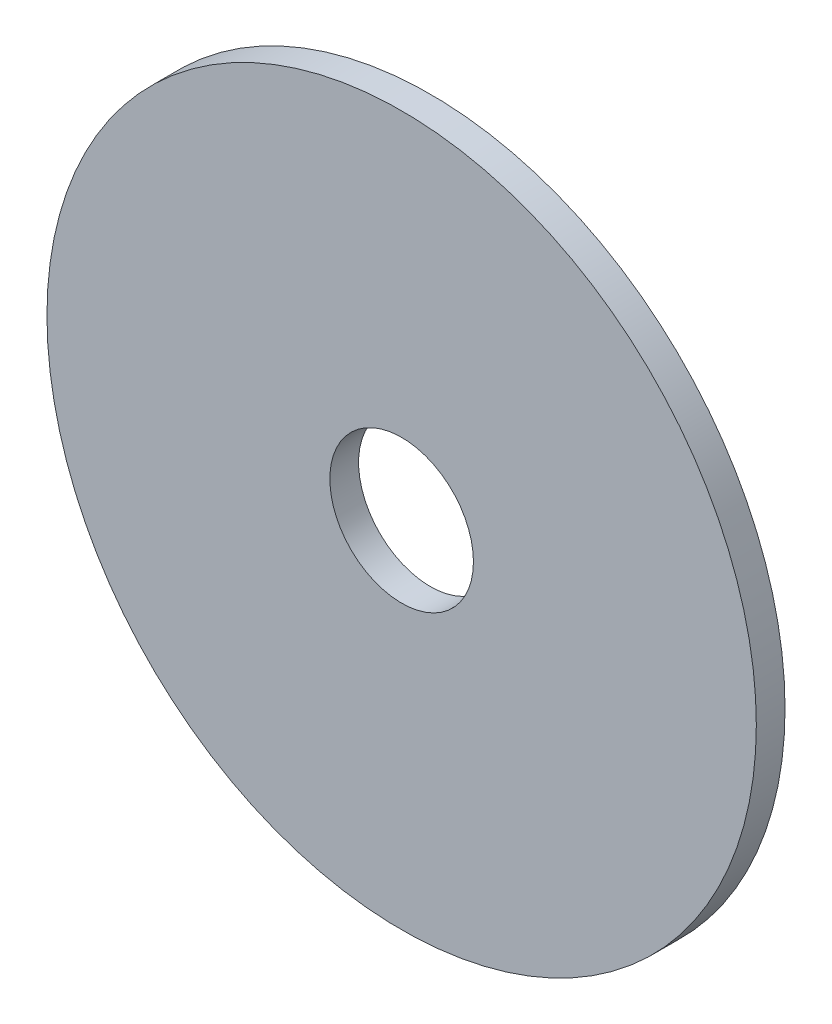
ISO-10303-21;
HEADER;
FILE_DESCRIPTION(('STEP AP214'),'2;1');
FILE_NAME('part.step','',(''),(''),'','','');
FILE_SCHEMA(('AUTOMOTIVE_DESIGN { 1 0 10303 214 1 1 1 1 }'));
ENDSEC;
DATA;
#1=APPLICATION_CONTEXT('core data for automotive mechanical design processes');
#2=APPLICATION_PROTOCOL_DEFINITION('international standard','automotive_design',2000,#1);
#3=PRODUCT_CONTEXT('',#1,'mechanical');
#4=PRODUCT('Part','Part','',(#3));
#5=PRODUCT_RELATED_PRODUCT_CATEGORY('part','',(#4));
#6=PRODUCT_DEFINITION_FORMATION('','',#4);
#7=PRODUCT_DEFINITION_CONTEXT('part definition',#1,'design');
#8=PRODUCT_DEFINITION('design','',#6,#7);
#9=PRODUCT_DEFINITION_SHAPE('','',#8);
#10=(LENGTH_UNIT() NAMED_UNIT(*) SI_UNIT(.MILLI.,.METRE.));
#11=(NAMED_UNIT(*) PLANE_ANGLE_UNIT() SI_UNIT($,.RADIAN.));
#12=(NAMED_UNIT(*) SI_UNIT($,.STERADIAN.) SOLID_ANGLE_UNIT());
#13=UNCERTAINTY_MEASURE_WITH_UNIT(LENGTH_MEASURE(1.E-05),#10,'distance_accuracy_value','');
#14=(GEOMETRIC_REPRESENTATION_CONTEXT(3) GLOBAL_UNCERTAINTY_ASSIGNED_CONTEXT((#13)) GLOBAL_UNIT_ASSIGNED_CONTEXT((#10,
#11,#12)) REPRESENTATION_CONTEXT('',''));
#15=CARTESIAN_POINT('',(0.,0.,0.));
#16=DIRECTION('',(0.,0.,1.));
#17=DIRECTION('',(1.,0.,0.));
#18=AXIS2_PLACEMENT_3D('',#15,#16,#17);
#19=CARTESIAN_POINT('',(0.,0.,1.));
#20=DIRECTION('',(0.,0.,1.));
#21=DIRECTION('',(1.,0.,0.));
#22=AXIS2_PLACEMENT_3D('',#19,#20,#21);
#23=PLANE('',#22);
#24=CARTESIAN_POINT('',(0.,0.,1.));
#25=DIRECTION('',(0.,0.,1.));
#26=DIRECTION('',(1.,0.,0.));
#27=AXIS2_PLACEMENT_3D('',#24,#25,#26);
#28=CIRCLE('',#27,12.35);
#29=CARTESIAN_POINT('',(12.35,0.,1.));
#30=VERTEX_POINT('',#29);
#31=EDGE_CURVE('E10',#30,#30,#28,.T.);
#32=ORIENTED_EDGE('',*,*,#31,.T.);
#33=EDGE_LOOP('',(#32));
#34=FACE_BOUND('',#33,.T.);
#35=CARTESIAN_POINT('',(0.,0.,1.));
#36=DIRECTION('',(0.,0.,1.));
#37=DIRECTION('',(1.,0.,0.));
#38=AXIS2_PLACEMENT_3D('',#35,#36,#37);
#39=CIRCLE('',#38,2.5);
#40=CARTESIAN_POINT('',(2.5,0.,1.));
#41=VERTEX_POINT('',#40);
#42=EDGE_CURVE('E50',#41,#41,#39,.T.);
#43=ORIENTED_EDGE('',*,*,#42,.F.);
#44=EDGE_LOOP('',(#43));
#45=FACE_BOUND('',#44,.T.);
#46=ADVANCED_FACE('F36',(#34,#45),#23,.T.);
#47=CARTESIAN_POINT('',(0.,0.,0.));
#48=DIRECTION('',(0.,0.,1.));
#49=DIRECTION('',(1.,0.,0.));
#50=AXIS2_PLACEMENT_3D('',#47,#48,#49);
#51=PLANE('',#50);
#52=CARTESIAN_POINT('',(0.,0.,0.));
#53=DIRECTION('',(0.,0.,1.));
#54=DIRECTION('',(1.,0.,0.));
#55=AXIS2_PLACEMENT_3D('',#52,#53,#54);
#56=CIRCLE('',#55,12.35);
#57=CARTESIAN_POINT('',(12.35,0.,0.));
#58=VERTEX_POINT('',#57);
#59=EDGE_CURVE('E40',#58,#58,#56,.T.);
#60=ORIENTED_EDGE('',*,*,#59,.F.);
#61=EDGE_LOOP('',(#60));
#62=FACE_BOUND('',#61,.T.);
#63=CARTESIAN_POINT('',(0.,0.,0.));
#64=DIRECTION('',(0.,0.,1.));
#65=DIRECTION('',(1.,0.,0.));
#66=AXIS2_PLACEMENT_3D('',#63,#64,#65);
#67=CIRCLE('',#66,2.5);
#68=CARTESIAN_POINT('',(2.5,0.,0.));
#69=VERTEX_POINT('',#68);
#70=EDGE_CURVE('E52',#69,#69,#67,.T.);
#71=ORIENTED_EDGE('',*,*,#70,.T.);
#72=EDGE_LOOP('',(#71));
#73=FACE_BOUND('',#72,.T.);
#74=ADVANCED_FACE('F65',(#62,#73),#51,.F.);
#75=CARTESIAN_POINT('',(0.,0.,1.));
#76=DIRECTION('',(0.,0.,-1.));
#77=DIRECTION('',(-1.,0.,0.));
#78=AXIS2_PLACEMENT_3D('',#75,#76,#77);
#79=CYLINDRICAL_SURFACE('',#78,12.35);
#80=ORIENTED_EDGE('',*,*,#31,.F.);
#81=EDGE_LOOP('',(#80));
#82=FACE_BOUND('',#81,.T.);
#83=ORIENTED_EDGE('',*,*,#59,.T.);
#84=EDGE_LOOP('',(#83));
#85=FACE_BOUND('',#84,.T.);
#86=ADVANCED_FACE('F38',(#82,#85),#79,.T.);
#87=CARTESIAN_POINT('',(0.,0.,1.));
#88=DIRECTION('',(0.,0.,-1.));
#89=DIRECTION('',(-1.,0.,0.));
#90=AXIS2_PLACEMENT_3D('',#87,#88,#89);
#91=CYLINDRICAL_SURFACE('',#90,2.5);
#92=ORIENTED_EDGE('',*,*,#42,.T.);
#93=EDGE_LOOP('',(#92));
#94=FACE_BOUND('',#93,.T.);
#95=ORIENTED_EDGE('',*,*,#70,.F.);
#96=EDGE_LOOP('',(#95));
#97=FACE_BOUND('',#96,.T.);
#98=ADVANCED_FACE('F61',(#94,#97),#91,.F.);
#99=CLOSED_SHELL('',(#46,#74,#86,#98));
#100=MANIFOLD_SOLID_BREP('B2',#99);
#101=ADVANCED_BREP_SHAPE_REPRESENTATION('',(#18,#100),#14);
#102=SHAPE_DEFINITION_REPRESENTATION(#9,#101);
ENDSEC;
END-ISO-10303-21;
